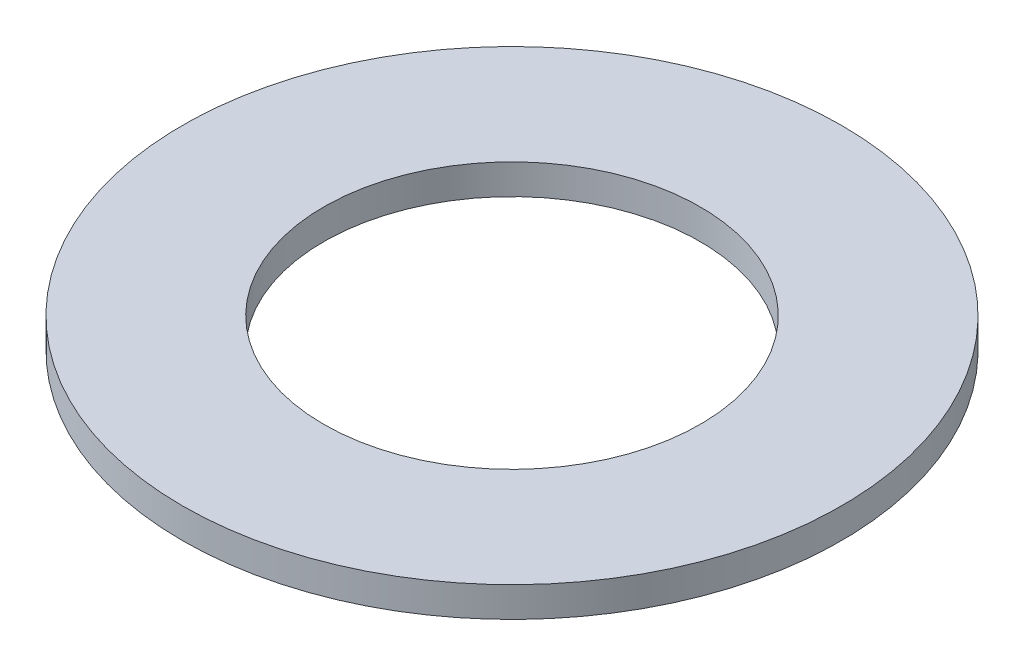
ISO-10303-21;
HEADER;
FILE_DESCRIPTION(('STEP AP214'),'2;1');
FILE_NAME('part.step','',(''),(''),'','','');
FILE_SCHEMA(('AUTOMOTIVE_DESIGN { 1 0 10303 214 1 1 1 1 }'));
ENDSEC;
DATA;
#1=APPLICATION_CONTEXT('core data for automotive mechanical design processes');
#2=APPLICATION_PROTOCOL_DEFINITION('international standard','automotive_design',2000,#1);
#3=PRODUCT_CONTEXT('',#1,'mechanical');
#4=PRODUCT('Part','Part','',(#3));
#5=PRODUCT_RELATED_PRODUCT_CATEGORY('part','',(#4));
#6=PRODUCT_DEFINITION_FORMATION('','',#4);
#7=PRODUCT_DEFINITION_CONTEXT('part definition',#1,'design');
#8=PRODUCT_DEFINITION('design','',#6,#7);
#9=PRODUCT_DEFINITION_SHAPE('','',#8);
#10=(LENGTH_UNIT() NAMED_UNIT(*) SI_UNIT(.MILLI.,.METRE.));
#11=(NAMED_UNIT(*) PLANE_ANGLE_UNIT() SI_UNIT($,.RADIAN.));
#12=(NAMED_UNIT(*) SI_UNIT($,.STERADIAN.) SOLID_ANGLE_UNIT());
#13=UNCERTAINTY_MEASURE_WITH_UNIT(LENGTH_MEASURE(1.E-05),#10,'distance_accuracy_value','');
#14=(GEOMETRIC_REPRESENTATION_CONTEXT(3) GLOBAL_UNCERTAINTY_ASSIGNED_CONTEXT((#13)) GLOBAL_UNIT_ASSIGNED_CONTEXT((#10,
#11,#12)) REPRESENTATION_CONTEXT('',''));
#15=CARTESIAN_POINT('',(0.,0.,0.));
#16=DIRECTION('',(0.,0.,1.));
#17=DIRECTION('',(1.,0.,0.));
#18=AXIS2_PLACEMENT_3D('',#15,#16,#17);
#19=CARTESIAN_POINT('',(0.,8.,0.));
#20=DIRECTION('',(0.,-1.,0.));
#21=DIRECTION('',(0.,0.,-1.));
#22=AXIS2_PLACEMENT_3D('',#19,#20,#21);
#23=CYLINDRICAL_SURFACE('',#22,87.5);
#24=CARTESIAN_POINT('',(0.,8.,0.));
#25=DIRECTION('',(0.,1.,0.));
#26=DIRECTION('',(0.,0.,1.));
#27=AXIS2_PLACEMENT_3D('',#24,#25,#26);
#28=CIRCLE('',#27,87.5);
#29=CARTESIAN_POINT('',(0.,8.,87.5));
#30=VERTEX_POINT('',#29);
#31=EDGE_CURVE('E10',#30,#30,#28,.T.);
#32=ORIENTED_EDGE('',*,*,#31,.F.);
#33=EDGE_LOOP('',(#32));
#34=FACE_BOUND('',#33,.T.);
#35=CARTESIAN_POINT('',(0.,0.,0.));
#36=DIRECTION('',(0.,1.,0.));
#37=DIRECTION('',(0.,0.,1.));
#38=AXIS2_PLACEMENT_3D('',#35,#36,#37);
#39=CIRCLE('',#38,87.5);
#40=CARTESIAN_POINT('',(0.,0.,87.5));
#41=VERTEX_POINT('',#40);
#42=EDGE_CURVE('E37',#41,#41,#39,.T.);
#43=ORIENTED_EDGE('',*,*,#42,.T.);
#44=EDGE_LOOP('',(#43));
#45=FACE_BOUND('',#44,.T.);
#46=ADVANCED_FACE('F40',(#34,#45),#23,.T.);
#47=CARTESIAN_POINT('',(0.,8.,0.));
#48=DIRECTION('',(0.,1.,0.));
#49=DIRECTION('',(0.,0.,1.));
#50=AXIS2_PLACEMENT_3D('',#47,#48,#49);
#51=PLANE('',#50);
#52=CARTESIAN_POINT('',(0.,8.,0.));
#53=DIRECTION('',(0.,1.,0.));
#54=DIRECTION('',(0.,0.,1.));
#55=AXIS2_PLACEMENT_3D('',#52,#53,#54);
#56=CIRCLE('',#55,50.);
#57=CARTESIAN_POINT('',(0.,8.,50.));
#58=VERTEX_POINT('',#57);
#59=EDGE_CURVE('E50',#58,#58,#56,.T.);
#60=ORIENTED_EDGE('',*,*,#59,.F.);
#61=EDGE_LOOP('',(#60));
#62=FACE_BOUND('',#61,.T.);
#63=ORIENTED_EDGE('',*,*,#31,.T.);
#64=EDGE_LOOP('',(#63));
#65=FACE_BOUND('',#64,.T.);
#66=ADVANCED_FACE('F59',(#62,#65),#51,.T.);
#67=CARTESIAN_POINT('',(0.,0.,0.));
#68=DIRECTION('',(0.,1.,0.));
#69=DIRECTION('',(0.,0.,1.));
#70=AXIS2_PLACEMENT_3D('',#67,#68,#69);
#71=PLANE('',#70);
#72=CARTESIAN_POINT('',(0.,0.,0.));
#73=DIRECTION('',(0.,1.,0.));
#74=DIRECTION('',(0.,0.,1.));
#75=AXIS2_PLACEMENT_3D('',#72,#73,#74);
#76=CIRCLE('',#75,50.);
#77=CARTESIAN_POINT('',(0.,0.,50.));
#78=VERTEX_POINT('',#77);
#79=EDGE_CURVE('E47',#78,#78,#76,.T.);
#80=ORIENTED_EDGE('',*,*,#79,.T.);
#81=EDGE_LOOP('',(#80));
#82=FACE_BOUND('',#81,.T.);
#83=ORIENTED_EDGE('',*,*,#42,.F.);
#84=EDGE_LOOP('',(#83));
#85=FACE_BOUND('',#84,.T.);
#86=ADVANCED_FACE('F58',(#82,#85),#71,.F.);
#87=CARTESIAN_POINT('',(0.,8.,0.));
#88=DIRECTION('',(0.,-1.,0.));
#89=DIRECTION('',(0.,0.,-1.));
#90=AXIS2_PLACEMENT_3D('',#87,#88,#89);
#91=CYLINDRICAL_SURFACE('',#90,50.);
#92=ORIENTED_EDGE('',*,*,#59,.T.);
#93=EDGE_LOOP('',(#92));
#94=FACE_BOUND('',#93,.T.);
#95=ORIENTED_EDGE('',*,*,#79,.F.);
#96=EDGE_LOOP('',(#95));
#97=FACE_BOUND('',#96,.T.);
#98=ADVANCED_FACE('F54',(#94,#97),#91,.F.);
#99=CLOSED_SHELL('',(#46,#66,#86,#98));
#100=MANIFOLD_SOLID_BREP('B2',#99);
#101=ADVANCED_BREP_SHAPE_REPRESENTATION('',(#18,#100),#14);
#102=SHAPE_DEFINITION_REPRESENTATION(#9,#101);
ENDSEC;
END-ISO-10303-21;
